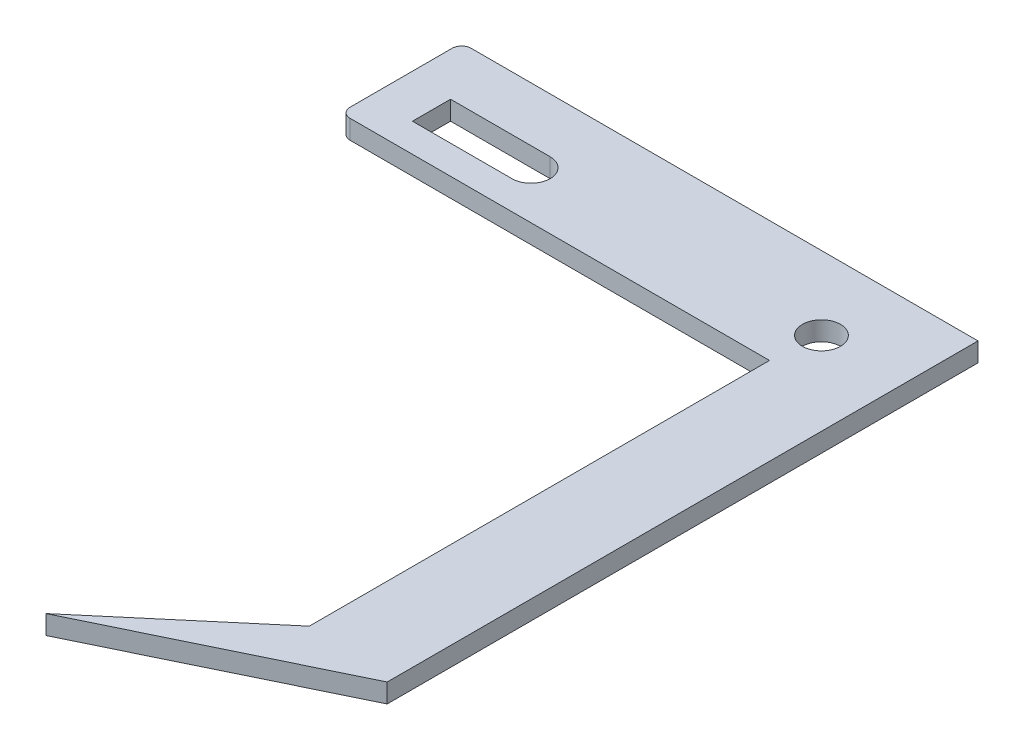
ISO-10303-21;
HEADER;
FILE_DESCRIPTION(('STEP AP214'),'2;1');
FILE_NAME('part.step','',(''),(''),'','','');
FILE_SCHEMA(('AUTOMOTIVE_DESIGN { 1 0 10303 214 1 1 1 1 }'));
ENDSEC;
DATA;
#1=APPLICATION_CONTEXT('core data for automotive mechanical design processes');
#2=APPLICATION_PROTOCOL_DEFINITION('international standard','automotive_design',2000,#1);
#3=PRODUCT_CONTEXT('',#1,'mechanical');
#4=PRODUCT('Part','Part','',(#3));
#5=PRODUCT_RELATED_PRODUCT_CATEGORY('part','',(#4));
#6=PRODUCT_DEFINITION_FORMATION('','',#4);
#7=PRODUCT_DEFINITION_CONTEXT('part definition',#1,'design');
#8=PRODUCT_DEFINITION('design','',#6,#7);
#9=PRODUCT_DEFINITION_SHAPE('','',#8);
#10=(LENGTH_UNIT() NAMED_UNIT(*) SI_UNIT(.MILLI.,.METRE.));
#11=(NAMED_UNIT(*) PLANE_ANGLE_UNIT() SI_UNIT($,.RADIAN.));
#12=(NAMED_UNIT(*) SI_UNIT($,.STERADIAN.) SOLID_ANGLE_UNIT());
#13=UNCERTAINTY_MEASURE_WITH_UNIT(LENGTH_MEASURE(1.E-05),#10,'distance_accuracy_value','');
#14=(GEOMETRIC_REPRESENTATION_CONTEXT(3) GLOBAL_UNCERTAINTY_ASSIGNED_CONTEXT((#13)) GLOBAL_UNIT_ASSIGNED_CONTEXT((#10,
#11,#12)) REPRESENTATION_CONTEXT('',''));
#15=CARTESIAN_POINT('',(0.,0.,0.));
#16=DIRECTION('',(0.,0.,1.));
#17=DIRECTION('',(1.,0.,0.));
#18=AXIS2_PLACEMENT_3D('',#15,#16,#17);
#19=CARTESIAN_POINT('',(1.,2.,-48.412862341502));
#20=DIRECTION('',(0.,1.,0.));
#21=DIRECTION('',(0.,0.,1.));
#22=AXIS2_PLACEMENT_3D('',#19,#20,#21);
#23=PLANE('',#22);
#24=DIRECTION('',(1.,0.,0.));
#25=VECTOR('',#24,1.);
#26=CARTESIAN_POINT('',(1.,2.,-36.6920301733855));
#27=LINE('',#26,#25);
#28=CARTESIAN_POINT('',(1.,2.,-36.6920301733855));
#29=VERTEX_POINT('',#28);
#30=CARTESIAN_POINT('',(45.0365276310284,2.,-36.6920301733855));
#31=VERTEX_POINT('',#30);
#32=EDGE_CURVE('E150',#29,#31,#27,.T.);
#33=ORIENTED_EDGE('',*,*,#32,.T.);
#34=DIRECTION('',(0.,0.,-1.));
#35=VECTOR('',#34,1.);
#36=CARTESIAN_POINT('',(45.0365276310284,2.,-36.6920301733855));
#37=LINE('',#36,#35);
#38=CARTESIAN_POINT('',(45.0365276310284,2.,11.6141165994602));
#39=VERTEX_POINT('',#38);
#40=EDGE_CURVE('E145',#39,#31,#37,.T.);
#41=ORIENTED_EDGE('',*,*,#40,.F.);
#42=DIRECTION('',(-0.763095427239992,0.,0.646285826028557));
#43=VECTOR('',#42,1.);
#44=CARTESIAN_POINT('',(38.3102977408543,2.,17.3107397024866));
#45=LINE('',#44,#43);
#46=CARTESIAN_POINT('',(30.071702425445,2.,24.2882253335987));
#47=VERTEX_POINT('',#46);
#48=EDGE_CURVE('E130',#39,#47,#45,.T.);
#49=ORIENTED_EDGE('',*,*,#48,.T.);
#50=DIRECTION('',(0.900013688421869,0.,-0.435861630168637));
#51=VECTOR('',#50,1.);
#52=CARTESIAN_POINT('',(30.071702425445,2.,24.2882253335987));
#53=LINE('',#52,#51);
#54=CARTESIAN_POINT('',(54.2008321681165,2.,12.6028899220536));
#55=VERTEX_POINT('',#54);
#56=EDGE_CURVE('E137',#47,#55,#53,.T.);
#57=ORIENTED_EDGE('',*,*,#56,.T.);
#58=DIRECTION('',(0.,0.,-1.));
#59=VECTOR('',#58,1.);
#60=CARTESIAN_POINT('',(54.2008321681165,2.,12.6028899220536));
#61=LINE('',#60,#59);
#62=CARTESIAN_POINT('',(54.2008321681165,2.,-49.412862341502));
#63=VERTEX_POINT('',#62);
#64=EDGE_CURVE('E188',#55,#63,#61,.T.);
#65=ORIENTED_EDGE('',*,*,#64,.T.);
#66=DIRECTION('',(-1.,0.,0.));
#67=VECTOR('',#66,1.);
#68=CARTESIAN_POINT('',(41.48,2.,-49.412862341502));
#69=LINE('',#68,#67);
#70=CARTESIAN_POINT('',(1.,2.,-49.412862341502));
#71=VERTEX_POINT('',#70);
#72=EDGE_CURVE('E190',#63,#71,#69,.T.);
#73=ORIENTED_EDGE('',*,*,#72,.T.);
#74=CARTESIAN_POINT('',(1.,2.,-48.412862341502));
#75=DIRECTION('',(0.,1.,0.));
#76=DIRECTION('',(0.,0.,1.));
#77=AXIS2_PLACEMENT_3D('',#74,#75,#76);
#78=CIRCLE('',#77,1.);
#79=CARTESIAN_POINT('',(0.,2.,-48.412862341502));
#80=VERTEX_POINT('',#79);
#81=EDGE_CURVE('E192',#71,#80,#78,.T.);
#82=ORIENTED_EDGE('',*,*,#81,.T.);
#83=DIRECTION('',(0.,0.,1.));
#84=VECTOR('',#83,1.);
#85=CARTESIAN_POINT('',(0.,2.,-48.412862341502));
#86=LINE('',#85,#84);
#87=CARTESIAN_POINT('',(0.,2.,-37.6920301733855));
#88=VERTEX_POINT('',#87);
#89=EDGE_CURVE('E194',#80,#88,#86,.T.);
#90=ORIENTED_EDGE('',*,*,#89,.T.);
#91=CARTESIAN_POINT('',(1.,2.,-37.6920301733855));
#92=DIRECTION('',(0.,1.,0.));
#93=DIRECTION('',(0.,0.,-1.));
#94=AXIS2_PLACEMENT_3D('',#91,#92,#93);
#95=CIRCLE('',#94,1.);
#96=EDGE_CURVE('E196',#88,#29,#95,.T.);
#97=ORIENTED_EDGE('',*,*,#96,.T.);
#98=EDGE_LOOP('',(#33,#41,#49,#57,#65,#73,#82,#90,#97));
#99=FACE_BOUND('',#98,.T.);
#100=CARTESIAN_POINT('',(45.48,2.,-41.7006090805018));
#101=DIRECTION('',(0.,1.,0.));
#102=DIRECTION('',(0.,0.,1.));
#103=AXIS2_PLACEMENT_3D('',#100,#101,#102);
#104=CIRCLE('',#103,2.);
#105=CARTESIAN_POINT('',(45.48,2.,-39.7006090805018));
#106=VERTEX_POINT('',#105);
#107=EDGE_CURVE('E181',#106,#106,#104,.T.);
#108=ORIENTED_EDGE('',*,*,#107,.F.);
#109=EDGE_LOOP('',(#108));
#110=FACE_BOUND('',#109,.T.);
#111=DIRECTION('',(-1.,0.,0.));
#112=VECTOR('',#111,1.);
#113=CARTESIAN_POINT('',(15.,2.,-43.7006090805018));
#114=LINE('',#113,#112);
#115=CARTESIAN_POINT('',(15.,2.,-43.7006090805018));
#116=VERTEX_POINT('',#115);
#117=CARTESIAN_POINT('',(4.54951644761081,2.,-43.7006090805018));
#118=VERTEX_POINT('',#117);
#119=EDGE_CURVE('E157',#116,#118,#114,.T.);
#120=ORIENTED_EDGE('',*,*,#119,.F.);
#121=CARTESIAN_POINT('',(15.,2.,-41.7006090805018));
#122=DIRECTION('',(0.,1.,0.));
#123=DIRECTION('',(0.,0.,1.));
#124=AXIS2_PLACEMENT_3D('',#121,#122,#123);
#125=CIRCLE('',#124,2.);
#126=CARTESIAN_POINT('',(15.,2.,-39.7006090805018));
#127=VERTEX_POINT('',#126);
#128=EDGE_CURVE('E155',#127,#116,#125,.T.);
#129=ORIENTED_EDGE('',*,*,#128,.F.);
#130=DIRECTION('',(1.,0.,0.));
#131=VECTOR('',#130,1.);
#132=CARTESIAN_POINT('',(4.54951644761081,2.,-39.7006090805018));
#133=LINE('',#132,#131);
#134=CARTESIAN_POINT('',(4.54951644761081,2.,-39.7006090805018));
#135=VERTEX_POINT('',#134);
#136=EDGE_CURVE('E162',#135,#127,#133,.T.);
#137=ORIENTED_EDGE('',*,*,#136,.F.);
#138=DIRECTION('',(0.,0.,1.));
#139=VECTOR('',#138,1.);
#140=CARTESIAN_POINT('',(4.54951644761081,2.,-43.7006090805018));
#141=LINE('',#140,#139);
#142=EDGE_CURVE('E160',#118,#135,#141,.T.);
#143=ORIENTED_EDGE('',*,*,#142,.F.);
#144=EDGE_LOOP('',(#120,#129,#137,#143));
#145=FACE_BOUND('',#144,.T.);
#146=ADVANCED_FACE('F33',(#99,#110,#145),#23,.T.);
#147=CARTESIAN_POINT('',(1.,0.,-48.412862341502));
#148=DIRECTION('',(0.,1.,0.));
#149=DIRECTION('',(0.,0.,1.));
#150=AXIS2_PLACEMENT_3D('',#147,#148,#149);
#151=PLANE('',#150);
#152=CARTESIAN_POINT('',(45.48,0.,-41.7006090805018));
#153=DIRECTION('',(0.,1.,0.));
#154=DIRECTION('',(0.,0.,1.));
#155=AXIS2_PLACEMENT_3D('',#152,#153,#154);
#156=CIRCLE('',#155,2.);
#157=CARTESIAN_POINT('',(45.48,0.,-39.7006090805018));
#158=VERTEX_POINT('',#157);
#159=EDGE_CURVE('E180',#158,#158,#156,.T.);
#160=ORIENTED_EDGE('',*,*,#159,.T.);
#161=EDGE_LOOP('',(#160));
#162=FACE_BOUND('',#161,.T.);
#163=DIRECTION('',(0.,0.,-1.));
#164=VECTOR('',#163,1.);
#165=CARTESIAN_POINT('',(45.0365276310284,0.,-48.412862341502));
#166=LINE('',#165,#164);
#167=CARTESIAN_POINT('',(45.0365276310284,0.,11.6141165994602));
#168=VERTEX_POINT('',#167);
#169=CARTESIAN_POINT('',(45.0365276310284,0.,-36.6920301733855));
#170=VERTEX_POINT('',#169);
#171=EDGE_CURVE('E11',#168,#170,#166,.T.);
#172=ORIENTED_EDGE('',*,*,#171,.T.);
#173=DIRECTION('',(1.,0.,0.));
#174=VECTOR('',#173,1.);
#175=CARTESIAN_POINT('',(31.48,0.,-36.6920301733855));
#176=LINE('',#175,#174);
#177=CARTESIAN_POINT('',(1.,0.,-36.6920301733855));
#178=VERTEX_POINT('',#177);
#179=EDGE_CURVE('E138',#178,#170,#176,.T.);
#180=ORIENTED_EDGE('',*,*,#179,.F.);
#181=CARTESIAN_POINT('',(1.,0.,-37.6920301733855));
#182=DIRECTION('',(0.,1.,0.));
#183=DIRECTION('',(0.,0.,-1.));
#184=AXIS2_PLACEMENT_3D('',#181,#182,#183);
#185=CIRCLE('',#184,1.);
#186=CARTESIAN_POINT('',(0.,0.,-37.6920301733855));
#187=VERTEX_POINT('',#186);
#188=EDGE_CURVE('E213',#187,#178,#185,.T.);
#189=ORIENTED_EDGE('',*,*,#188,.F.);
#190=DIRECTION('',(0.,0.,1.));
#191=VECTOR('',#190,1.);
#192=CARTESIAN_POINT('',(0.,0.,-48.412862341502));
#193=LINE('',#192,#191);
#194=CARTESIAN_POINT('',(0.,0.,-48.412862341502));
#195=VERTEX_POINT('',#194);
#196=EDGE_CURVE('E211',#195,#187,#193,.T.);
#197=ORIENTED_EDGE('',*,*,#196,.F.);
#198=CARTESIAN_POINT('',(1.,0.,-48.412862341502));
#199=DIRECTION('',(0.,1.,0.));
#200=DIRECTION('',(0.,0.,1.));
#201=AXIS2_PLACEMENT_3D('',#198,#199,#200);
#202=CIRCLE('',#201,1.);
#203=CARTESIAN_POINT('',(1.,0.,-49.412862341502));
#204=VERTEX_POINT('',#203);
#205=EDGE_CURVE('E209',#204,#195,#202,.T.);
#206=ORIENTED_EDGE('',*,*,#205,.F.);
#207=DIRECTION('',(-1.,0.,0.));
#208=VECTOR('',#207,1.);
#209=CARTESIAN_POINT('',(1.,0.,-49.412862341502));
#210=LINE('',#209,#208);
#211=CARTESIAN_POINT('',(54.2008321681165,0.,-49.412862341502));
#212=VERTEX_POINT('',#211);
#213=EDGE_CURVE('E207',#212,#204,#210,.T.);
#214=ORIENTED_EDGE('',*,*,#213,.F.);
#215=DIRECTION('',(0.,0.,-1.));
#216=VECTOR('',#215,1.);
#217=CARTESIAN_POINT('',(54.2008321681165,0.,-49.412862341502));
#218=LINE('',#217,#216);
#219=CARTESIAN_POINT('',(54.2008321681165,0.,12.6028899220536));
#220=VERTEX_POINT('',#219);
#221=EDGE_CURVE('E204',#220,#212,#218,.T.);
#222=ORIENTED_EDGE('',*,*,#221,.F.);
#223=DIRECTION('',(0.900013688421869,0.,-0.435861630168637));
#224=VECTOR('',#223,1.);
#225=CARTESIAN_POINT('',(30.071702425445,0.,24.2882253335987));
#226=LINE('',#225,#224);
#227=CARTESIAN_POINT('',(30.071702425445,0.,24.2882253335987));
#228=VERTEX_POINT('',#227);
#229=EDGE_CURVE('E201',#228,#220,#226,.T.);
#230=ORIENTED_EDGE('',*,*,#229,.F.);
#231=DIRECTION('',(-0.763095427239992,0.,0.646285826028557));
#232=VECTOR('',#231,1.);
#233=CARTESIAN_POINT('',(30.071702425445,0.,24.2882253335987));
#234=LINE('',#233,#232);
#235=EDGE_CURVE('E184',#168,#228,#234,.T.);
#236=ORIENTED_EDGE('',*,*,#235,.F.);
#237=EDGE_LOOP('',(#172,#180,#189,#197,#206,#214,#222,#230,#236));
#238=FACE_BOUND('',#237,.T.);
#239=CARTESIAN_POINT('',(15.,0.,-41.7006090805018));
#240=DIRECTION('',(0.,1.,0.));
#241=DIRECTION('',(0.,0.,1.));
#242=AXIS2_PLACEMENT_3D('',#239,#240,#241);
#243=CIRCLE('',#242,2.);
#244=CARTESIAN_POINT('',(15.,0.,-39.7006090805018));
#245=VERTEX_POINT('',#244);
#246=CARTESIAN_POINT('',(15.,0.,-43.7006090805018));
#247=VERTEX_POINT('',#246);
#248=EDGE_CURVE('E56',#245,#247,#243,.T.);
#249=ORIENTED_EDGE('',*,*,#248,.T.);
#250=DIRECTION('',(-1.,0.,0.));
#251=VECTOR('',#250,1.);
#252=CARTESIAN_POINT('',(15.,0.,-43.7006090805018));
#253=LINE('',#252,#251);
#254=CARTESIAN_POINT('',(4.54951644761081,0.,-43.7006090805018));
#255=VERTEX_POINT('',#254);
#256=EDGE_CURVE('E166',#247,#255,#253,.T.);
#257=ORIENTED_EDGE('',*,*,#256,.T.);
#258=DIRECTION('',(0.,0.,1.));
#259=VECTOR('',#258,1.);
#260=CARTESIAN_POINT('',(4.54951644761081,0.,-43.7006090805018));
#261=LINE('',#260,#259);
#262=CARTESIAN_POINT('',(4.54951644761081,0.,-39.7006090805018));
#263=VERTEX_POINT('',#262);
#264=EDGE_CURVE('E169',#255,#263,#261,.T.);
#265=ORIENTED_EDGE('',*,*,#264,.T.);
#266=DIRECTION('',(1.,0.,0.));
#267=VECTOR('',#266,1.);
#268=CARTESIAN_POINT('',(4.54951644761081,0.,-39.7006090805018));
#269=LINE('',#268,#267);
#270=EDGE_CURVE('E158',#263,#245,#269,.T.);
#271=ORIENTED_EDGE('',*,*,#270,.T.);
#272=EDGE_LOOP('',(#249,#257,#265,#271));
#273=FACE_BOUND('',#272,.T.);
#274=ADVANCED_FACE('F238',(#162,#238,#273),#151,.F.);
#275=CARTESIAN_POINT('',(30.071702425445,2.,24.2882253335987));
#276=DIRECTION('',(0.646285826028557,0.,0.763095427239992));
#277=DIRECTION('',(0.763095427239992,0.,-0.646285826028557));
#278=AXIS2_PLACEMENT_3D('',#275,#276,#277);
#279=PLANE('',#278);
#280=ORIENTED_EDGE('',*,*,#235,.T.);
#281=DIRECTION('',(0.,-1.,0.));
#282=VECTOR('',#281,1.);
#283=CARTESIAN_POINT('',(30.071702425445,2.,24.2882253335987));
#284=LINE('',#283,#282);
#285=EDGE_CURVE('E41',#47,#228,#284,.T.);
#286=ORIENTED_EDGE('',*,*,#285,.F.);
#287=ORIENTED_EDGE('',*,*,#48,.F.);
#288=DIRECTION('',(0.,1.,0.));
#289=VECTOR('',#288,1.);
#290=CARTESIAN_POINT('',(45.0365276310284,-7.,11.6141165994602));
#291=LINE('',#290,#289);
#292=EDGE_CURVE('E132',#168,#39,#291,.T.);
#293=ORIENTED_EDGE('',*,*,#292,.F.);
#294=EDGE_LOOP('',(#280,#286,#287,#293));
#295=FACE_BOUND('',#294,.T.);
#296=ADVANCED_FACE('F35',(#295),#279,.F.);
#297=CARTESIAN_POINT('',(30.071702425445,2.,24.2882253335987));
#298=DIRECTION('',(-0.435861630168637,0.,-0.90001368842187));
#299=DIRECTION('',(-0.90001368842187,0.,0.435861630168637));
#300=AXIS2_PLACEMENT_3D('',#297,#298,#299);
#301=PLANE('',#300);
#302=ORIENTED_EDGE('',*,*,#229,.T.);
#303=DIRECTION('',(0.,-1.,0.));
#304=VECTOR('',#303,1.);
#305=CARTESIAN_POINT('',(54.2008321681165,2.,12.6028899220536));
#306=LINE('',#305,#304);
#307=EDGE_CURVE('E231',#55,#220,#306,.T.);
#308=ORIENTED_EDGE('',*,*,#307,.F.);
#309=ORIENTED_EDGE('',*,*,#56,.F.);
#310=ORIENTED_EDGE('',*,*,#285,.T.);
#311=EDGE_LOOP('',(#302,#308,#309,#310));
#312=FACE_BOUND('',#311,.T.);
#313=ADVANCED_FACE('F235',(#312),#301,.F.);
#314=CARTESIAN_POINT('',(54.2008321681165,2.,-49.412862341502));
#315=DIRECTION('',(-1.,0.,0.));
#316=DIRECTION('',(0.,0.,1.));
#317=AXIS2_PLACEMENT_3D('',#314,#315,#316);
#318=PLANE('',#317);
#319=ORIENTED_EDGE('',*,*,#221,.T.);
#320=DIRECTION('',(0.,-1.,0.));
#321=VECTOR('',#320,1.);
#322=CARTESIAN_POINT('',(54.2008321681165,2.,-49.412862341502));
#323=LINE('',#322,#321);
#324=EDGE_CURVE('E228',#63,#212,#323,.T.);
#325=ORIENTED_EDGE('',*,*,#324,.F.);
#326=ORIENTED_EDGE('',*,*,#64,.F.);
#327=ORIENTED_EDGE('',*,*,#307,.T.);
#328=EDGE_LOOP('',(#319,#325,#326,#327));
#329=FACE_BOUND('',#328,.T.);
#330=ADVANCED_FACE('F243',(#329),#318,.F.);
#331=CARTESIAN_POINT('',(1.,2.,-49.412862341502));
#332=DIRECTION('',(0.,0.,1.));
#333=DIRECTION('',(1.,0.,0.));
#334=AXIS2_PLACEMENT_3D('',#331,#332,#333);
#335=PLANE('',#334);
#336=ORIENTED_EDGE('',*,*,#213,.T.);
#337=DIRECTION('',(0.,-1.,0.));
#338=VECTOR('',#337,1.);
#339=CARTESIAN_POINT('',(1.,2.,-49.412862341502));
#340=LINE('',#339,#338);
#341=EDGE_CURVE('E225',#71,#204,#340,.T.);
#342=ORIENTED_EDGE('',*,*,#341,.F.);
#343=ORIENTED_EDGE('',*,*,#72,.F.);
#344=ORIENTED_EDGE('',*,*,#324,.T.);
#345=EDGE_LOOP('',(#336,#342,#343,#344));
#346=FACE_BOUND('',#345,.T.);
#347=ADVANCED_FACE('F247',(#346),#335,.F.);
#348=CARTESIAN_POINT('',(1.,2.,-48.412862341502));
#349=DIRECTION('',(0.,-1.,0.));
#350=DIRECTION('',(0.,0.,-1.));
#351=AXIS2_PLACEMENT_3D('',#348,#349,#350);
#352=CYLINDRICAL_SURFACE('',#351,1.);
#353=ORIENTED_EDGE('',*,*,#205,.T.);
#354=DIRECTION('',(0.,-1.,0.));
#355=VECTOR('',#354,1.);
#356=CARTESIAN_POINT('',(0.,2.,-48.412862341502));
#357=LINE('',#356,#355);
#358=EDGE_CURVE('E222',#80,#195,#357,.T.);
#359=ORIENTED_EDGE('',*,*,#358,.F.);
#360=ORIENTED_EDGE('',*,*,#81,.F.);
#361=ORIENTED_EDGE('',*,*,#341,.T.);
#362=EDGE_LOOP('',(#353,#359,#360,#361));
#363=FACE_BOUND('',#362,.T.);
#364=ADVANCED_FACE('F254',(#363),#352,.T.);
#365=CARTESIAN_POINT('',(0.,2.,-48.412862341502));
#366=DIRECTION('',(1.,0.,0.));
#367=DIRECTION('',(0.,0.,-1.));
#368=AXIS2_PLACEMENT_3D('',#365,#366,#367);
#369=PLANE('',#368);
#370=ORIENTED_EDGE('',*,*,#196,.T.);
#371=DIRECTION('',(0.,-1.,0.));
#372=VECTOR('',#371,1.);
#373=CARTESIAN_POINT('',(0.,2.,-37.6920301733855));
#374=LINE('',#373,#372);
#375=EDGE_CURVE('E219',#88,#187,#374,.T.);
#376=ORIENTED_EDGE('',*,*,#375,.F.);
#377=ORIENTED_EDGE('',*,*,#89,.F.);
#378=ORIENTED_EDGE('',*,*,#358,.T.);
#379=EDGE_LOOP('',(#370,#376,#377,#378));
#380=FACE_BOUND('',#379,.T.);
#381=ADVANCED_FACE('F257',(#380),#369,.F.);
#382=CARTESIAN_POINT('',(1.,2.,-37.6920301733855));
#383=DIRECTION('',(0.,-1.,0.));
#384=DIRECTION('',(0.,0.,-1.));
#385=AXIS2_PLACEMENT_3D('',#382,#383,#384);
#386=CYLINDRICAL_SURFACE('',#385,1.);
#387=ORIENTED_EDGE('',*,*,#188,.T.);
#388=DIRECTION('',(0.,-1.,0.));
#389=VECTOR('',#388,1.);
#390=CARTESIAN_POINT('',(1.,2.,-36.6920301733855));
#391=LINE('',#390,#389);
#392=EDGE_CURVE('E199',#29,#178,#391,.T.);
#393=ORIENTED_EDGE('',*,*,#392,.F.);
#394=ORIENTED_EDGE('',*,*,#96,.F.);
#395=ORIENTED_EDGE('',*,*,#375,.T.);
#396=EDGE_LOOP('',(#387,#393,#394,#395));
#397=FACE_BOUND('',#396,.T.);
#398=ADVANCED_FACE('F262',(#397),#386,.T.);
#399=CARTESIAN_POINT('',(31.48,2.,-36.6920301733855));
#400=DIRECTION('',(0.,0.,-1.));
#401=DIRECTION('',(-1.,0.,0.));
#402=AXIS2_PLACEMENT_3D('',#399,#400,#401);
#403=PLANE('',#402);
#404=ORIENTED_EDGE('',*,*,#179,.T.);
#405=DIRECTION('',(0.,1.,0.));
#406=VECTOR('',#405,1.);
#407=CARTESIAN_POINT('',(45.0365276310284,-7.,-36.6920301733855));
#408=LINE('',#407,#406);
#409=EDGE_CURVE('E146',#170,#31,#408,.T.);
#410=ORIENTED_EDGE('',*,*,#409,.T.);
#411=ORIENTED_EDGE('',*,*,#32,.F.);
#412=ORIENTED_EDGE('',*,*,#392,.T.);
#413=EDGE_LOOP('',(#404,#410,#411,#412));
#414=FACE_BOUND('',#413,.T.);
#415=ADVANCED_FACE('F264',(#414),#403,.F.);
#416=CARTESIAN_POINT('',(45.48,2.,-41.7006090805018));
#417=DIRECTION('',(0.,-1.,0.));
#418=DIRECTION('',(0.,0.,-1.));
#419=AXIS2_PLACEMENT_3D('',#416,#417,#418);
#420=CYLINDRICAL_SURFACE('',#419,2.);
#421=ORIENTED_EDGE('',*,*,#107,.T.);
#422=EDGE_LOOP('',(#421));
#423=FACE_BOUND('',#422,.T.);
#424=ORIENTED_EDGE('',*,*,#159,.F.);
#425=EDGE_LOOP('',(#424));
#426=FACE_BOUND('',#425,.T.);
#427=ADVANCED_FACE('F266',(#423,#426),#420,.F.);
#428=CARTESIAN_POINT('',(15.,2.,-41.7006090805018));
#429=DIRECTION('',(0.,-1.,0.));
#430=DIRECTION('',(0.,0.,-1.));
#431=AXIS2_PLACEMENT_3D('',#428,#429,#430);
#432=CYLINDRICAL_SURFACE('',#431,2.);
#433=ORIENTED_EDGE('',*,*,#248,.F.);
#434=DIRECTION('',(0.,-1.,0.));
#435=VECTOR('',#434,1.);
#436=CARTESIAN_POINT('',(15.,2.,-39.7006090805018));
#437=LINE('',#436,#435);
#438=EDGE_CURVE('E164',#127,#245,#437,.T.);
#439=ORIENTED_EDGE('',*,*,#438,.F.);
#440=ORIENTED_EDGE('',*,*,#128,.T.);
#441=DIRECTION('',(0.,-1.,0.));
#442=VECTOR('',#441,1.);
#443=CARTESIAN_POINT('',(15.,2.,-43.7006090805018));
#444=LINE('',#443,#442);
#445=EDGE_CURVE('E178',#116,#247,#444,.T.);
#446=ORIENTED_EDGE('',*,*,#445,.T.);
#447=EDGE_LOOP('',(#433,#439,#440,#446));
#448=FACE_BOUND('',#447,.T.);
#449=ADVANCED_FACE('F272',(#448),#432,.F.);
#450=CARTESIAN_POINT('',(15.,2.,-43.7006090805018));
#451=DIRECTION('',(0.,0.,1.));
#452=DIRECTION('',(1.,0.,0.));
#453=AXIS2_PLACEMENT_3D('',#450,#451,#452);
#454=PLANE('',#453);
#455=ORIENTED_EDGE('',*,*,#256,.F.);
#456=ORIENTED_EDGE('',*,*,#445,.F.);
#457=ORIENTED_EDGE('',*,*,#119,.T.);
#458=DIRECTION('',(0.,-1.,0.));
#459=VECTOR('',#458,1.);
#460=CARTESIAN_POINT('',(4.54951644761081,2.,-43.7006090805018));
#461=LINE('',#460,#459);
#462=EDGE_CURVE('E176',#118,#255,#461,.T.);
#463=ORIENTED_EDGE('',*,*,#462,.T.);
#464=EDGE_LOOP('',(#455,#456,#457,#463));
#465=FACE_BOUND('',#464,.T.);
#466=ADVANCED_FACE('F286',(#465),#454,.T.);
#467=CARTESIAN_POINT('',(4.54951644761081,2.,-43.7006090805018));
#468=DIRECTION('',(1.,0.,0.));
#469=DIRECTION('',(0.,0.,-1.));
#470=AXIS2_PLACEMENT_3D('',#467,#468,#469);
#471=PLANE('',#470);
#472=ORIENTED_EDGE('',*,*,#264,.F.);
#473=ORIENTED_EDGE('',*,*,#462,.F.);
#474=ORIENTED_EDGE('',*,*,#142,.T.);
#475=DIRECTION('',(0.,-1.,0.));
#476=VECTOR('',#475,1.);
#477=CARTESIAN_POINT('',(4.54951644761081,2.,-39.7006090805018));
#478=LINE('',#477,#476);
#479=EDGE_CURVE('E48',#135,#263,#478,.T.);
#480=ORIENTED_EDGE('',*,*,#479,.T.);
#481=EDGE_LOOP('',(#472,#473,#474,#480));
#482=FACE_BOUND('',#481,.T.);
#483=ADVANCED_FACE('F289',(#482),#471,.T.);
#484=CARTESIAN_POINT('',(4.54951644761081,2.,-39.7006090805018));
#485=DIRECTION('',(0.,0.,-1.));
#486=DIRECTION('',(-1.,0.,0.));
#487=AXIS2_PLACEMENT_3D('',#484,#485,#486);
#488=PLANE('',#487);
#489=ORIENTED_EDGE('',*,*,#270,.F.);
#490=ORIENTED_EDGE('',*,*,#479,.F.);
#491=ORIENTED_EDGE('',*,*,#136,.T.);
#492=ORIENTED_EDGE('',*,*,#438,.T.);
#493=EDGE_LOOP('',(#489,#490,#491,#492));
#494=FACE_BOUND('',#493,.T.);
#495=ADVANCED_FACE('F293',(#494),#488,.T.);
#496=CARTESIAN_POINT('',(45.0365276310284,-7.,-36.6920301733855));
#497=DIRECTION('',(1.,0.,0.));
#498=DIRECTION('',(0.,0.,-1.));
#499=AXIS2_PLACEMENT_3D('',#496,#497,#498);
#500=PLANE('',#499);
#501=ORIENTED_EDGE('',*,*,#292,.T.);
#502=ORIENTED_EDGE('',*,*,#40,.T.);
#503=ORIENTED_EDGE('',*,*,#409,.F.);
#504=ORIENTED_EDGE('',*,*,#171,.F.);
#505=EDGE_LOOP('',(#501,#502,#503,#504));
#506=FACE_BOUND('',#505,.T.);
#507=ADVANCED_FACE('F143',(#506),#500,.F.);
#508=CLOSED_SHELL('',(#146,#274,#296,#313,#330,#347,#364,#381,#398,#415,#427,#449,#466,#483,
#495,#507));
#509=MANIFOLD_SOLID_BREP('B2',#508);
#510=ADVANCED_BREP_SHAPE_REPRESENTATION('',(#18,#509),#14);
#511=SHAPE_DEFINITION_REPRESENTATION(#9,#510);
ENDSEC;
END-ISO-10303-21;
